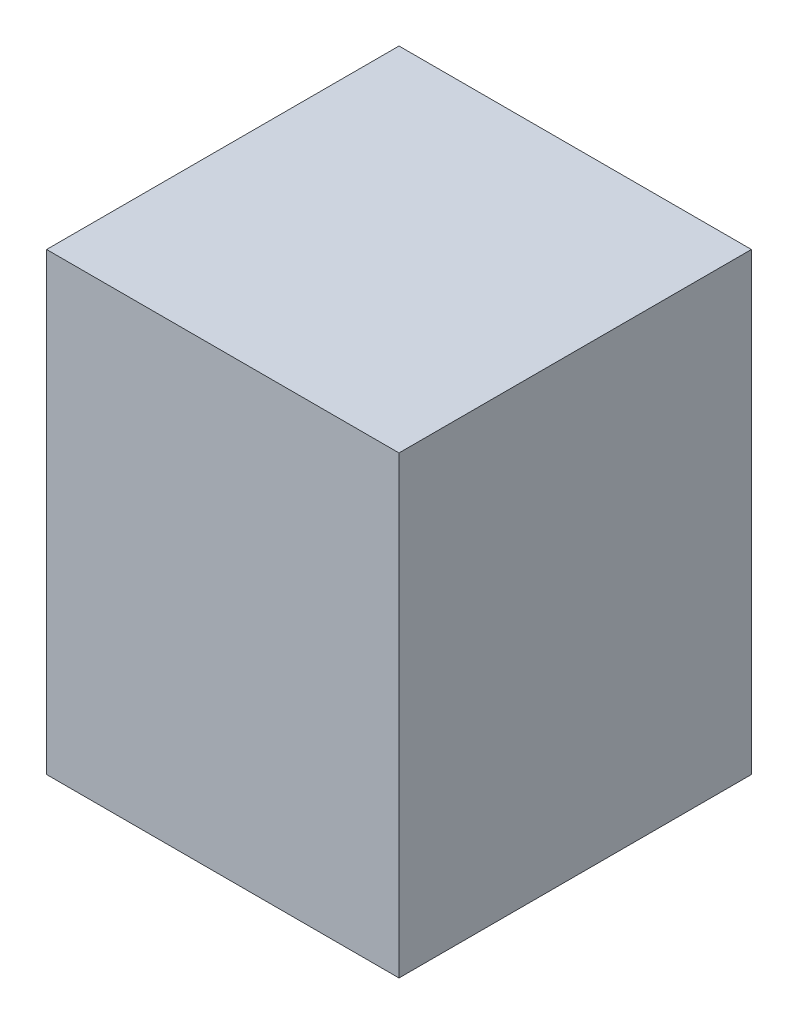
ISO-10303-21;
HEADER;
FILE_DESCRIPTION(('STEP AP214'),'2;1');
FILE_NAME('part.step','',(''),(''),'','','');
FILE_SCHEMA(('AUTOMOTIVE_DESIGN { 1 0 10303 214 1 1 1 1 }'));
ENDSEC;
DATA;
#1=APPLICATION_CONTEXT('core data for automotive mechanical design processes');
#2=APPLICATION_PROTOCOL_DEFINITION('international standard','automotive_design',2000,#1);
#3=PRODUCT_CONTEXT('',#1,'mechanical');
#4=PRODUCT('Part','Part','',(#3));
#5=PRODUCT_RELATED_PRODUCT_CATEGORY('part','',(#4));
#6=PRODUCT_DEFINITION_FORMATION('','',#4);
#7=PRODUCT_DEFINITION_CONTEXT('part definition',#1,'design');
#8=PRODUCT_DEFINITION('design','',#6,#7);
#9=PRODUCT_DEFINITION_SHAPE('','',#8);
#10=(LENGTH_UNIT() NAMED_UNIT(*) SI_UNIT(.MILLI.,.METRE.));
#11=(NAMED_UNIT(*) PLANE_ANGLE_UNIT() SI_UNIT($,.RADIAN.));
#12=(NAMED_UNIT(*) SI_UNIT($,.STERADIAN.) SOLID_ANGLE_UNIT());
#13=UNCERTAINTY_MEASURE_WITH_UNIT(LENGTH_MEASURE(1.E-05),#10,'distance_accuracy_value','');
#14=(GEOMETRIC_REPRESENTATION_CONTEXT(3) GLOBAL_UNCERTAINTY_ASSIGNED_CONTEXT((#13)) GLOBAL_UNIT_ASSIGNED_CONTEXT((#10,
#11,#12)) REPRESENTATION_CONTEXT('',''));
#15=CARTESIAN_POINT('',(0.,0.,0.));
#16=DIRECTION('',(0.,0.,1.));
#17=DIRECTION('',(1.,0.,0.));
#18=AXIS2_PLACEMENT_3D('',#15,#16,#17);
#19=CARTESIAN_POINT('',(0.,406.4,5.08));
#20=DIRECTION('',(0.,0.,1.));
#21=DIRECTION('',(1.,0.,0.));
#22=AXIS2_PLACEMENT_3D('',#19,#20,#21);
#23=PLANE('',#22);
#24=DIRECTION('',(-1.,0.,0.));
#25=VECTOR('',#24,1.);
#26=CARTESIAN_POINT('',(0.,0.,5.08));
#27=LINE('',#26,#25);
#28=CARTESIAN_POINT('',(309.88,0.,5.08));
#29=VERTEX_POINT('',#28);
#30=CARTESIAN_POINT('',(-5.08,0.,5.08));
#31=VERTEX_POINT('',#30);
#32=EDGE_CURVE('E98',#29,#31,#27,.T.);
#33=ORIENTED_EDGE('',*,*,#32,.F.);
#34=DIRECTION('',(0.,-1.,0.));
#35=VECTOR('',#34,1.);
#36=CARTESIAN_POINT('',(309.88,406.4,5.08));
#37=LINE('',#36,#35);
#38=CARTESIAN_POINT('',(309.88,406.4,5.08));
#39=VERTEX_POINT('',#38);
#40=EDGE_CURVE('E11',#39,#29,#37,.T.);
#41=ORIENTED_EDGE('',*,*,#40,.F.);
#42=DIRECTION('',(-1.,0.,0.));
#43=VECTOR('',#42,1.);
#44=CARTESIAN_POINT('',(0.,406.4,5.08));
#45=LINE('',#44,#43);
#46=CARTESIAN_POINT('',(-5.08,406.4,5.08));
#47=VERTEX_POINT('',#46);
#48=EDGE_CURVE('E90',#39,#47,#45,.T.);
#49=ORIENTED_EDGE('',*,*,#48,.T.);
#50=DIRECTION('',(0.,-1.,0.));
#51=VECTOR('',#50,1.);
#52=CARTESIAN_POINT('',(-5.08,406.4,5.08));
#53=LINE('',#52,#51);
#54=EDGE_CURVE('E51',#47,#31,#53,.T.);
#55=ORIENTED_EDGE('',*,*,#54,.T.);
#56=EDGE_LOOP('',(#33,#41,#49,#55));
#57=FACE_BOUND('',#56,.T.);
#58=ADVANCED_FACE('F35',(#57),#23,.T.);
#59=CARTESIAN_POINT('',(309.88,406.4,0.));
#60=DIRECTION('',(1.,0.,0.));
#61=DIRECTION('',(0.,0.,-1.));
#62=AXIS2_PLACEMENT_3D('',#59,#60,#61);
#63=PLANE('',#62);
#64=DIRECTION('',(0.,0.,1.));
#65=VECTOR('',#64,1.);
#66=CARTESIAN_POINT('',(309.88,0.,0.));
#67=LINE('',#66,#65);
#68=CARTESIAN_POINT('',(309.88,0.,-309.88));
#69=VERTEX_POINT('',#68);
#70=EDGE_CURVE('E81',#69,#29,#67,.T.);
#71=ORIENTED_EDGE('',*,*,#70,.F.);
#72=DIRECTION('',(0.,-1.,0.));
#73=VECTOR('',#72,1.);
#74=CARTESIAN_POINT('',(309.88,406.4,-309.88));
#75=LINE('',#74,#73);
#76=CARTESIAN_POINT('',(309.88,406.4,-309.88));
#77=VERTEX_POINT('',#76);
#78=EDGE_CURVE('E43',#77,#69,#75,.T.);
#79=ORIENTED_EDGE('',*,*,#78,.F.);
#80=DIRECTION('',(0.,0.,1.));
#81=VECTOR('',#80,1.);
#82=CARTESIAN_POINT('',(309.88,406.4,0.));
#83=LINE('',#82,#81);
#84=EDGE_CURVE('E79',#77,#39,#83,.T.);
#85=ORIENTED_EDGE('',*,*,#84,.T.);
#86=ORIENTED_EDGE('',*,*,#40,.T.);
#87=EDGE_LOOP('',(#71,#79,#85,#86));
#88=FACE_BOUND('',#87,.T.);
#89=ADVANCED_FACE('F78',(#88),#63,.T.);
#90=CARTESIAN_POINT('',(0.,406.4,-309.88));
#91=DIRECTION('',(0.,0.,-1.));
#92=DIRECTION('',(-1.,0.,0.));
#93=AXIS2_PLACEMENT_3D('',#90,#91,#92);
#94=PLANE('',#93);
#95=DIRECTION('',(1.,0.,0.));
#96=VECTOR('',#95,1.);
#97=CARTESIAN_POINT('',(0.,0.,-309.88));
#98=LINE('',#97,#96);
#99=CARTESIAN_POINT('',(-5.08,0.,-309.88));
#100=VERTEX_POINT('',#99);
#101=EDGE_CURVE('E101',#100,#69,#98,.T.);
#102=ORIENTED_EDGE('',*,*,#101,.F.);
#103=DIRECTION('',(0.,-1.,0.));
#104=VECTOR('',#103,1.);
#105=CARTESIAN_POINT('',(-5.08,406.4,-309.88));
#106=LINE('',#105,#104);
#107=CARTESIAN_POINT('',(-5.08,406.4,-309.88));
#108=VERTEX_POINT('',#107);
#109=EDGE_CURVE('E64',#108,#100,#106,.T.);
#110=ORIENTED_EDGE('',*,*,#109,.F.);
#111=DIRECTION('',(1.,0.,0.));
#112=VECTOR('',#111,1.);
#113=CARTESIAN_POINT('',(0.,406.4,-309.88));
#114=LINE('',#113,#112);
#115=EDGE_CURVE('E89',#108,#77,#114,.T.);
#116=ORIENTED_EDGE('',*,*,#115,.T.);
#117=ORIENTED_EDGE('',*,*,#78,.T.);
#118=EDGE_LOOP('',(#102,#110,#116,#117));
#119=FACE_BOUND('',#118,.T.);
#120=ADVANCED_FACE('F92',(#119),#94,.T.);
#121=CARTESIAN_POINT('',(-5.08,406.4,0.));
#122=DIRECTION('',(-1.,0.,0.));
#123=DIRECTION('',(0.,0.,1.));
#124=AXIS2_PLACEMENT_3D('',#121,#122,#123);
#125=PLANE('',#124);
#126=DIRECTION('',(0.,0.,-1.));
#127=VECTOR('',#126,1.);
#128=CARTESIAN_POINT('',(-5.08,0.,0.));
#129=LINE('',#128,#127);
#130=EDGE_CURVE('E103',#31,#100,#129,.T.);
#131=ORIENTED_EDGE('',*,*,#130,.F.);
#132=ORIENTED_EDGE('',*,*,#54,.F.);
#133=DIRECTION('',(0.,0.,-1.));
#134=VECTOR('',#133,1.);
#135=CARTESIAN_POINT('',(-5.08,406.4,0.));
#136=LINE('',#135,#134);
#137=EDGE_CURVE('E93',#47,#108,#136,.T.);
#138=ORIENTED_EDGE('',*,*,#137,.T.);
#139=ORIENTED_EDGE('',*,*,#109,.T.);
#140=EDGE_LOOP('',(#131,#132,#138,#139));
#141=FACE_BOUND('',#140,.T.);
#142=ADVANCED_FACE('F108',(#141),#125,.T.);
#143=CARTESIAN_POINT('',(0.,406.4,0.));
#144=DIRECTION('',(0.,1.,0.));
#145=DIRECTION('',(0.,0.,1.));
#146=AXIS2_PLACEMENT_3D('',#143,#144,#145);
#147=PLANE('',#146);
#148=ORIENTED_EDGE('',*,*,#48,.F.);
#149=ORIENTED_EDGE('',*,*,#84,.F.);
#150=ORIENTED_EDGE('',*,*,#115,.F.);
#151=ORIENTED_EDGE('',*,*,#137,.F.);
#152=EDGE_LOOP('',(#148,#149,#150,#151));
#153=FACE_BOUND('',#152,.T.);
#154=ADVANCED_FACE('F87',(#153),#147,.T.);
#155=CARTESIAN_POINT('',(0.,0.,0.));
#156=DIRECTION('',(0.,1.,0.));
#157=DIRECTION('',(0.,0.,1.));
#158=AXIS2_PLACEMENT_3D('',#155,#156,#157);
#159=PLANE('',#158);
#160=ORIENTED_EDGE('',*,*,#32,.T.);
#161=ORIENTED_EDGE('',*,*,#130,.T.);
#162=ORIENTED_EDGE('',*,*,#101,.T.);
#163=ORIENTED_EDGE('',*,*,#70,.T.);
#164=EDGE_LOOP('',(#160,#161,#162,#163));
#165=FACE_BOUND('',#164,.T.);
#166=ADVANCED_FACE('F115',(#165),#159,.F.);
#167=CLOSED_SHELL('',(#58,#89,#120,#142,#154,#166));
#168=MANIFOLD_SOLID_BREP('B2',#167);
#169=ADVANCED_BREP_SHAPE_REPRESENTATION('',(#18,#168),#14);
#170=SHAPE_DEFINITION_REPRESENTATION(#9,#169);
ENDSEC;
END-ISO-10303-21;
